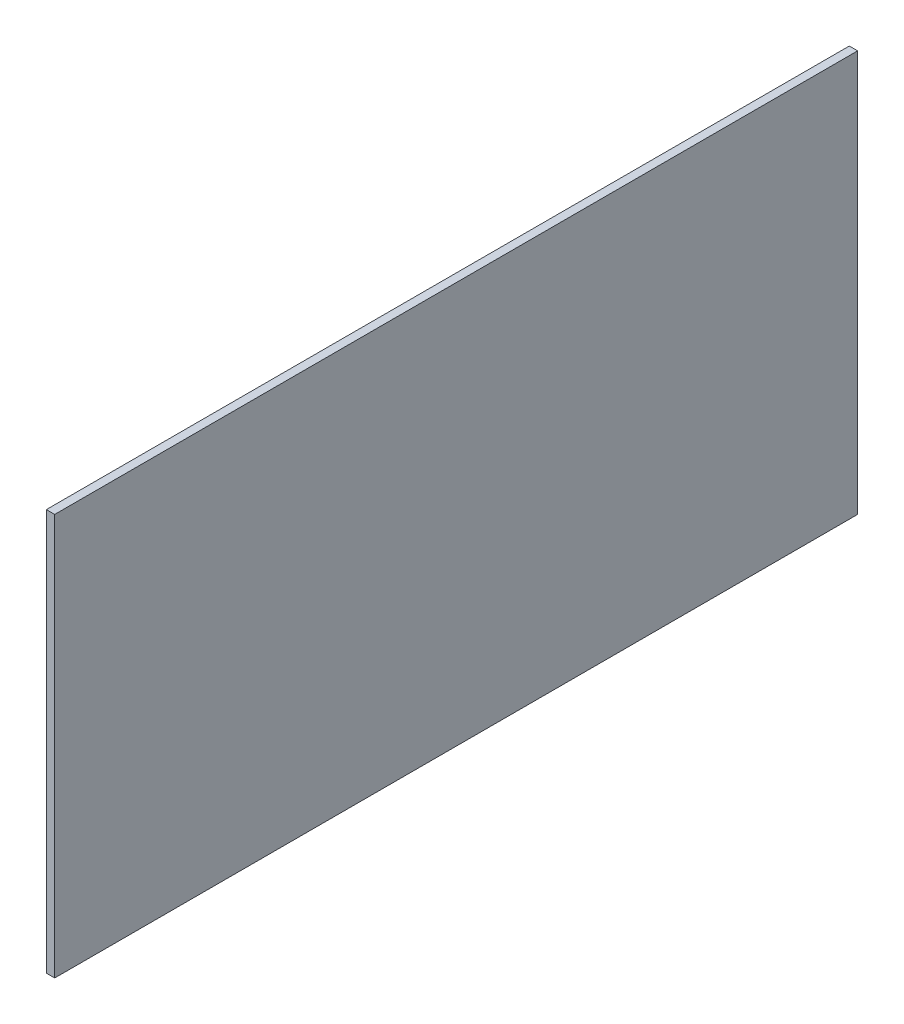
ISO-10303-21;
HEADER;
FILE_DESCRIPTION(('STEP AP214'),'2;1');
FILE_NAME('part.step','',(''),(''),'','','');
FILE_SCHEMA(('AUTOMOTIVE_DESIGN { 1 0 10303 214 1 1 1 1 }'));
ENDSEC;
DATA;
#1=APPLICATION_CONTEXT('core data for automotive mechanical design processes');
#2=APPLICATION_PROTOCOL_DEFINITION('international standard','automotive_design',2000,#1);
#3=PRODUCT_CONTEXT('',#1,'mechanical');
#4=PRODUCT('Part','Part','',(#3));
#5=PRODUCT_RELATED_PRODUCT_CATEGORY('part','',(#4));
#6=PRODUCT_DEFINITION_FORMATION('','',#4);
#7=PRODUCT_DEFINITION_CONTEXT('part definition',#1,'design');
#8=PRODUCT_DEFINITION('design','',#6,#7);
#9=PRODUCT_DEFINITION_SHAPE('','',#8);
#10=(LENGTH_UNIT() NAMED_UNIT(*) SI_UNIT(.MILLI.,.METRE.));
#11=(NAMED_UNIT(*) PLANE_ANGLE_UNIT() SI_UNIT($,.RADIAN.));
#12=(NAMED_UNIT(*) SI_UNIT($,.STERADIAN.) SOLID_ANGLE_UNIT());
#13=UNCERTAINTY_MEASURE_WITH_UNIT(LENGTH_MEASURE(1.E-05),#10,'distance_accuracy_value','');
#14=(GEOMETRIC_REPRESENTATION_CONTEXT(3) GLOBAL_UNCERTAINTY_ASSIGNED_CONTEXT((#13)) GLOBAL_UNIT_ASSIGNED_CONTEXT((#10,
#11,#12)) REPRESENTATION_CONTEXT('',''));
#15=CARTESIAN_POINT('',(0.,0.,0.));
#16=DIRECTION('',(0.,0.,1.));
#17=DIRECTION('',(1.,0.,0.));
#18=AXIS2_PLACEMENT_3D('',#15,#16,#17);
#19=CARTESIAN_POINT('',(1.5875,-38.1,-76.2));
#20=DIRECTION('',(0.,0.,1.));
#21=DIRECTION('',(1.,0.,0.));
#22=AXIS2_PLACEMENT_3D('',#19,#20,#21);
#23=PLANE('',#22);
#24=DIRECTION('',(0.,1.,0.));
#25=VECTOR('',#24,1.);
#26=CARTESIAN_POINT('',(0.,-38.1,-76.2));
#27=LINE('',#26,#25);
#28=CARTESIAN_POINT('',(0.,-38.1,-76.2));
#29=VERTEX_POINT('',#28);
#30=CARTESIAN_POINT('',(0.,38.1,-76.2));
#31=VERTEX_POINT('',#30);
#32=EDGE_CURVE('E96',#29,#31,#27,.T.);
#33=ORIENTED_EDGE('',*,*,#32,.T.);
#34=DIRECTION('',(-1.,0.,0.));
#35=VECTOR('',#34,1.);
#36=CARTESIAN_POINT('',(1.5875,38.1,-76.2));
#37=LINE('',#36,#35);
#38=CARTESIAN_POINT('',(1.5875,38.1,-76.2));
#39=VERTEX_POINT('',#38);
#40=EDGE_CURVE('E11',#39,#31,#37,.T.);
#41=ORIENTED_EDGE('',*,*,#40,.F.);
#42=DIRECTION('',(0.,1.,0.));
#43=VECTOR('',#42,1.);
#44=CARTESIAN_POINT('',(1.5875,-38.1,-76.2));
#45=LINE('',#44,#43);
#46=CARTESIAN_POINT('',(1.5875,-38.1,-76.2));
#47=VERTEX_POINT('',#46);
#48=EDGE_CURVE('E84',#47,#39,#45,.T.);
#49=ORIENTED_EDGE('',*,*,#48,.F.);
#50=DIRECTION('',(-1.,0.,0.));
#51=VECTOR('',#50,1.);
#52=CARTESIAN_POINT('',(1.5875,-38.1,-76.2));
#53=LINE('',#52,#51);
#54=EDGE_CURVE('E92',#47,#29,#53,.T.);
#55=ORIENTED_EDGE('',*,*,#54,.T.);
#56=EDGE_LOOP('',(#33,#41,#49,#55));
#57=FACE_BOUND('',#56,.T.);
#58=ADVANCED_FACE('F33',(#57),#23,.F.);
#59=CARTESIAN_POINT('',(1.5875,38.1,76.2));
#60=DIRECTION('',(0.,-1.,0.));
#61=DIRECTION('',(0.,0.,-1.));
#62=AXIS2_PLACEMENT_3D('',#59,#60,#61);
#63=PLANE('',#62);
#64=DIRECTION('',(0.,0.,1.));
#65=VECTOR('',#64,1.);
#66=CARTESIAN_POINT('',(0.,38.1,76.2));
#67=LINE('',#66,#65);
#68=CARTESIAN_POINT('',(0.,38.1,76.2));
#69=VERTEX_POINT('',#68);
#70=EDGE_CURVE('E88',#31,#69,#67,.T.);
#71=ORIENTED_EDGE('',*,*,#70,.T.);
#72=DIRECTION('',(-1.,0.,0.));
#73=VECTOR('',#72,1.);
#74=CARTESIAN_POINT('',(1.5875,38.1,76.2));
#75=LINE('',#74,#73);
#76=CARTESIAN_POINT('',(1.5875,38.1,76.2));
#77=VERTEX_POINT('',#76);
#78=EDGE_CURVE('E41',#77,#69,#75,.T.);
#79=ORIENTED_EDGE('',*,*,#78,.F.);
#80=DIRECTION('',(0.,0.,1.));
#81=VECTOR('',#80,1.);
#82=CARTESIAN_POINT('',(1.5875,38.1,76.2));
#83=LINE('',#82,#81);
#84=EDGE_CURVE('E79',#39,#77,#83,.T.);
#85=ORIENTED_EDGE('',*,*,#84,.F.);
#86=ORIENTED_EDGE('',*,*,#40,.T.);
#87=EDGE_LOOP('',(#71,#79,#85,#86));
#88=FACE_BOUND('',#87,.T.);
#89=ADVANCED_FACE('F87',(#88),#63,.F.);
#90=CARTESIAN_POINT('',(1.5875,-38.1,76.2));
#91=DIRECTION('',(0.,0.,-1.));
#92=DIRECTION('',(-1.,0.,0.));
#93=AXIS2_PLACEMENT_3D('',#90,#91,#92);
#94=PLANE('',#93);
#95=DIRECTION('',(0.,-1.,0.));
#96=VECTOR('',#95,1.);
#97=CARTESIAN_POINT('',(0.,-38.1,76.2));
#98=LINE('',#97,#96);
#99=CARTESIAN_POINT('',(0.,-38.1,76.2));
#100=VERTEX_POINT('',#99);
#101=EDGE_CURVE('E66',#69,#100,#98,.T.);
#102=ORIENTED_EDGE('',*,*,#101,.T.);
#103=DIRECTION('',(-1.,0.,0.));
#104=VECTOR('',#103,1.);
#105=CARTESIAN_POINT('',(1.5875,-38.1,76.2));
#106=LINE('',#105,#104);
#107=CARTESIAN_POINT('',(1.5875,-38.1,76.2));
#108=VERTEX_POINT('',#107);
#109=EDGE_CURVE('E89',#108,#100,#106,.T.);
#110=ORIENTED_EDGE('',*,*,#109,.F.);
#111=DIRECTION('',(0.,-1.,0.));
#112=VECTOR('',#111,1.);
#113=CARTESIAN_POINT('',(1.5875,-38.1,76.2));
#114=LINE('',#113,#112);
#115=EDGE_CURVE('E82',#77,#108,#114,.T.);
#116=ORIENTED_EDGE('',*,*,#115,.F.);
#117=ORIENTED_EDGE('',*,*,#78,.T.);
#118=EDGE_LOOP('',(#102,#110,#116,#117));
#119=FACE_BOUND('',#118,.T.);
#120=ADVANCED_FACE('F90',(#119),#94,.F.);
#121=CARTESIAN_POINT('',(1.5875,-38.1,76.2));
#122=DIRECTION('',(0.,1.,0.));
#123=DIRECTION('',(0.,0.,1.));
#124=AXIS2_PLACEMENT_3D('',#121,#122,#123);
#125=PLANE('',#124);
#126=DIRECTION('',(0.,0.,-1.));
#127=VECTOR('',#126,1.);
#128=CARTESIAN_POINT('',(0.,-38.1,76.2));
#129=LINE('',#128,#127);
#130=EDGE_CURVE('E72',#100,#29,#129,.T.);
#131=ORIENTED_EDGE('',*,*,#130,.T.);
#132=ORIENTED_EDGE('',*,*,#54,.F.);
#133=DIRECTION('',(0.,0.,-1.));
#134=VECTOR('',#133,1.);
#135=CARTESIAN_POINT('',(1.5875,-38.1,76.2));
#136=LINE('',#135,#134);
#137=EDGE_CURVE('E49',#108,#47,#136,.T.);
#138=ORIENTED_EDGE('',*,*,#137,.F.);
#139=ORIENTED_EDGE('',*,*,#109,.T.);
#140=EDGE_LOOP('',(#131,#132,#138,#139));
#141=FACE_BOUND('',#140,.T.);
#142=ADVANCED_FACE('F103',(#141),#125,.F.);
#143=CARTESIAN_POINT('',(1.5875,0.,0.));
#144=DIRECTION('',(-1.,0.,0.));
#145=DIRECTION('',(0.,0.,1.));
#146=AXIS2_PLACEMENT_3D('',#143,#144,#145);
#147=PLANE('',#146);
#148=ORIENTED_EDGE('',*,*,#48,.T.);
#149=ORIENTED_EDGE('',*,*,#84,.T.);
#150=ORIENTED_EDGE('',*,*,#115,.T.);
#151=ORIENTED_EDGE('',*,*,#137,.T.);
#152=EDGE_LOOP('',(#148,#149,#150,#151));
#153=FACE_BOUND('',#152,.T.);
#154=ADVANCED_FACE('F80',(#153),#147,.F.);
#155=CARTESIAN_POINT('',(0.,0.,0.));
#156=DIRECTION('',(-1.,0.,0.));
#157=DIRECTION('',(0.,0.,1.));
#158=AXIS2_PLACEMENT_3D('',#155,#156,#157);
#159=PLANE('',#158);
#160=ORIENTED_EDGE('',*,*,#32,.F.);
#161=ORIENTED_EDGE('',*,*,#130,.F.);
#162=ORIENTED_EDGE('',*,*,#101,.F.);
#163=ORIENTED_EDGE('',*,*,#70,.F.);
#164=EDGE_LOOP('',(#160,#161,#162,#163));
#165=FACE_BOUND('',#164,.T.);
#166=ADVANCED_FACE('F106',(#165),#159,.T.);
#167=CLOSED_SHELL('',(#58,#89,#120,#142,#154,#166));
#168=MANIFOLD_SOLID_BREP('B2',#167);
#169=ADVANCED_BREP_SHAPE_REPRESENTATION('',(#18,#168),#14);
#170=SHAPE_DEFINITION_REPRESENTATION(#9,#169);
ENDSEC;
END-ISO-10303-21;
